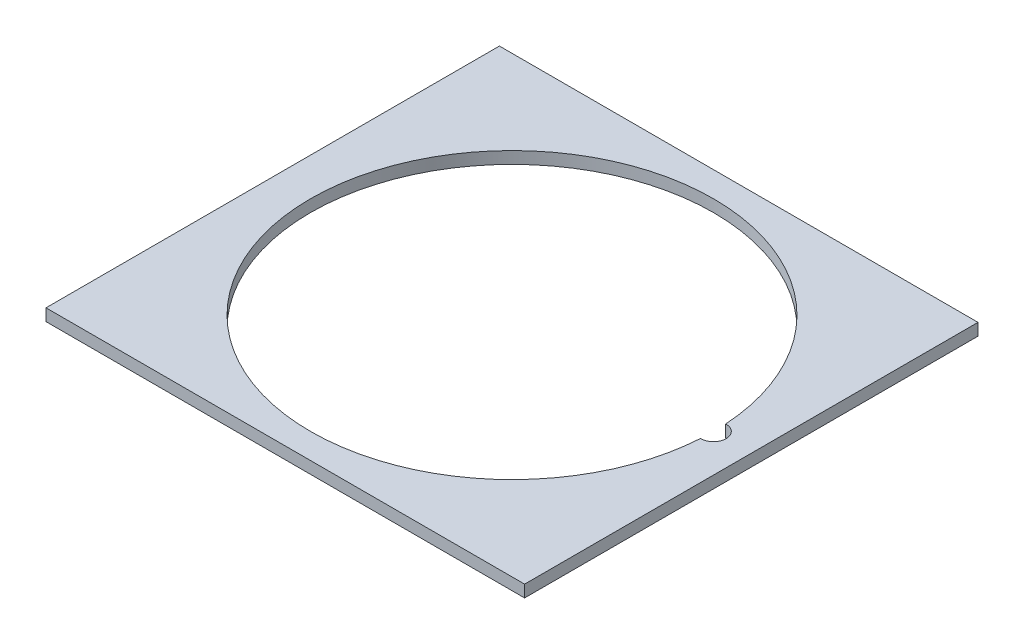
ISO-10303-21;
HEADER;
FILE_DESCRIPTION(('STEP AP214'),'2;1');
FILE_NAME('part.step','',(''),(''),'','','');
FILE_SCHEMA(('AUTOMOTIVE_DESIGN { 1 0 10303 214 1 1 1 1 }'));
ENDSEC;
DATA;
#1=APPLICATION_CONTEXT('core data for automotive mechanical design processes');
#2=APPLICATION_PROTOCOL_DEFINITION('international standard','automotive_design',2000,#1);
#3=PRODUCT_CONTEXT('',#1,'mechanical');
#4=PRODUCT('Part','Part','',(#3));
#5=PRODUCT_RELATED_PRODUCT_CATEGORY('part','',(#4));
#6=PRODUCT_DEFINITION_FORMATION('','',#4);
#7=PRODUCT_DEFINITION_CONTEXT('part definition',#1,'design');
#8=PRODUCT_DEFINITION('design','',#6,#7);
#9=PRODUCT_DEFINITION_SHAPE('','',#8);
#10=(LENGTH_UNIT() NAMED_UNIT(*) SI_UNIT(.MILLI.,.METRE.));
#11=(NAMED_UNIT(*) PLANE_ANGLE_UNIT() SI_UNIT($,.RADIAN.));
#12=(NAMED_UNIT(*) SI_UNIT($,.STERADIAN.) SOLID_ANGLE_UNIT());
#13=UNCERTAINTY_MEASURE_WITH_UNIT(LENGTH_MEASURE(1.E-05),#10,'distance_accuracy_value','');
#14=(GEOMETRIC_REPRESENTATION_CONTEXT(3) GLOBAL_UNCERTAINTY_ASSIGNED_CONTEXT((#13)) GLOBAL_UNIT_ASSIGNED_CONTEXT((#10,
#11,#12)) REPRESENTATION_CONTEXT('',''));
#15=CARTESIAN_POINT('',(0.,0.,0.));
#16=DIRECTION('',(0.,0.,1.));
#17=DIRECTION('',(1.,0.,0.));
#18=AXIS2_PLACEMENT_3D('',#15,#16,#17);
#19=CARTESIAN_POINT('',(-95.,4.7625,90.));
#20=DIRECTION('',(0.,1.,0.));
#21=DIRECTION('',(0.,0.,1.));
#22=AXIS2_PLACEMENT_3D('',#19,#20,#21);
#23=PLANE('',#22);
#24=DIRECTION('',(0.,0.,1.));
#25=VECTOR('',#24,1.);
#26=CARTESIAN_POINT('',(-95.,4.7625,-90.));
#27=LINE('',#26,#25);
#28=CARTESIAN_POINT('',(-95.,4.7625,-90.));
#29=VERTEX_POINT('',#28);
#30=CARTESIAN_POINT('',(-95.,4.7625,90.));
#31=VERTEX_POINT('',#30);
#32=EDGE_CURVE('E100',#29,#31,#27,.T.);
#33=ORIENTED_EDGE('',*,*,#32,.T.);
#34=DIRECTION('',(1.,0.,0.));
#35=VECTOR('',#34,1.);
#36=CARTESIAN_POINT('',(-95.,4.7625,90.));
#37=LINE('',#36,#35);
#38=CARTESIAN_POINT('',(95.,4.7625,90.));
#39=VERTEX_POINT('',#38);
#40=EDGE_CURVE('E103',#31,#39,#37,.T.);
#41=ORIENTED_EDGE('',*,*,#40,.T.);
#42=DIRECTION('',(0.,0.,-1.));
#43=VECTOR('',#42,1.);
#44=CARTESIAN_POINT('',(95.,4.7625,-90.));
#45=LINE('',#44,#43);
#46=CARTESIAN_POINT('',(95.,4.7625,-90.));
#47=VERTEX_POINT('',#46);
#48=EDGE_CURVE('E106',#39,#47,#45,.T.);
#49=ORIENTED_EDGE('',*,*,#48,.T.);
#50=DIRECTION('',(-1.,0.,0.));
#51=VECTOR('',#50,1.);
#52=CARTESIAN_POINT('',(-95.,4.7625,-90.));
#53=LINE('',#52,#51);
#54=EDGE_CURVE('E108',#47,#29,#53,.T.);
#55=ORIENTED_EDGE('',*,*,#54,.T.);
#56=EDGE_LOOP('',(#33,#41,#49,#55));
#57=FACE_BOUND('',#56,.T.);
#58=CARTESIAN_POINT('',(0.,4.7625,0.));
#59=DIRECTION('',(0.,1.,0.));
#60=DIRECTION('',(0.,0.,1.));
#61=AXIS2_PLACEMENT_3D('',#58,#59,#60);
#62=CIRCLE('',#61,80.);
#63=CARTESIAN_POINT('',(79.84375,4.7625,-4.99755799741234));
#64=VERTEX_POINT('',#63);
#65=CARTESIAN_POINT('',(79.84375,4.7625,4.99755799741233));
#66=VERTEX_POINT('',#65);
#67=EDGE_CURVE('E83',#64,#66,#62,.T.);
#68=ORIENTED_EDGE('',*,*,#67,.F.);
#69=CARTESIAN_POINT('',(80.,4.7625,0.));
#70=DIRECTION('',(0.,1.,0.));
#71=DIRECTION('',(0.,0.,1.));
#72=AXIS2_PLACEMENT_3D('',#69,#70,#71);
#73=CIRCLE('',#72,5.);
#74=EDGE_CURVE('E89',#66,#64,#73,.T.);
#75=ORIENTED_EDGE('',*,*,#74,.F.);
#76=EDGE_LOOP('',(#68,#75));
#77=FACE_BOUND('',#76,.T.);
#78=ADVANCED_FACE('F31',(#57,#77),#23,.T.);
#79=CARTESIAN_POINT('',(-95.,0.,90.));
#80=DIRECTION('',(0.,1.,0.));
#81=DIRECTION('',(0.,0.,1.));
#82=AXIS2_PLACEMENT_3D('',#79,#80,#81);
#83=PLANE('',#82);
#84=DIRECTION('',(0.,0.,1.));
#85=VECTOR('',#84,1.);
#86=CARTESIAN_POINT('',(-95.,0.,-90.));
#87=LINE('',#86,#85);
#88=CARTESIAN_POINT('',(-95.,0.,-90.));
#89=VERTEX_POINT('',#88);
#90=CARTESIAN_POINT('',(-95.,0.,90.));
#91=VERTEX_POINT('',#90);
#92=EDGE_CURVE('E99',#89,#91,#87,.T.);
#93=ORIENTED_EDGE('',*,*,#92,.F.);
#94=DIRECTION('',(-1.,0.,0.));
#95=VECTOR('',#94,1.);
#96=CARTESIAN_POINT('',(-95.,0.,-90.));
#97=LINE('',#96,#95);
#98=CARTESIAN_POINT('',(95.,0.,-90.));
#99=VERTEX_POINT('',#98);
#100=EDGE_CURVE('E104',#99,#89,#97,.T.);
#101=ORIENTED_EDGE('',*,*,#100,.F.);
#102=DIRECTION('',(0.,0.,-1.));
#103=VECTOR('',#102,1.);
#104=CARTESIAN_POINT('',(95.,0.,-90.));
#105=LINE('',#104,#103);
#106=CARTESIAN_POINT('',(95.,0.,90.));
#107=VERTEX_POINT('',#106);
#108=EDGE_CURVE('E115',#107,#99,#105,.T.);
#109=ORIENTED_EDGE('',*,*,#108,.F.);
#110=DIRECTION('',(1.,0.,0.));
#111=VECTOR('',#110,1.);
#112=CARTESIAN_POINT('',(-95.,0.,90.));
#113=LINE('',#112,#111);
#114=EDGE_CURVE('E113',#91,#107,#113,.T.);
#115=ORIENTED_EDGE('',*,*,#114,.F.);
#116=EDGE_LOOP('',(#93,#101,#109,#115));
#117=FACE_BOUND('',#116,.T.);
#118=CARTESIAN_POINT('',(80.,0.,0.));
#119=DIRECTION('',(0.,1.,0.));
#120=DIRECTION('',(0.,0.,1.));
#121=AXIS2_PLACEMENT_3D('',#118,#119,#120);
#122=CIRCLE('',#121,5.);
#123=CARTESIAN_POINT('',(79.84375,0.,4.99755799741233));
#124=VERTEX_POINT('',#123);
#125=CARTESIAN_POINT('',(79.84375,0.,-4.99755799741234));
#126=VERTEX_POINT('',#125);
#127=EDGE_CURVE('E53',#124,#126,#122,.T.);
#128=ORIENTED_EDGE('',*,*,#127,.T.);
#129=CARTESIAN_POINT('',(0.,0.,0.));
#130=DIRECTION('',(0.,1.,0.));
#131=DIRECTION('',(0.,0.,1.));
#132=AXIS2_PLACEMENT_3D('',#129,#130,#131);
#133=CIRCLE('',#132,80.);
#134=EDGE_CURVE('E93',#126,#124,#133,.T.);
#135=ORIENTED_EDGE('',*,*,#134,.T.);
#136=EDGE_LOOP('',(#128,#135));
#137=FACE_BOUND('',#136,.T.);
#138=ADVANCED_FACE('F133',(#117,#137),#83,.F.);
#139=CARTESIAN_POINT('',(-95.,4.7625,-90.));
#140=DIRECTION('',(1.,0.,0.));
#141=DIRECTION('',(0.,0.,-1.));
#142=AXIS2_PLACEMENT_3D('',#139,#140,#141);
#143=PLANE('',#142);
#144=ORIENTED_EDGE('',*,*,#92,.T.);
#145=DIRECTION('',(0.,-1.,0.));
#146=VECTOR('',#145,1.);
#147=CARTESIAN_POINT('',(-95.,4.7625,90.));
#148=LINE('',#147,#146);
#149=EDGE_CURVE('E11',#31,#91,#148,.T.);
#150=ORIENTED_EDGE('',*,*,#149,.F.);
#151=ORIENTED_EDGE('',*,*,#32,.F.);
#152=DIRECTION('',(0.,-1.,0.));
#153=VECTOR('',#152,1.);
#154=CARTESIAN_POINT('',(-95.,4.7625,-90.));
#155=LINE('',#154,#153);
#156=EDGE_CURVE('E110',#29,#89,#155,.T.);
#157=ORIENTED_EDGE('',*,*,#156,.T.);
#158=EDGE_LOOP('',(#144,#150,#151,#157));
#159=FACE_BOUND('',#158,.T.);
#160=ADVANCED_FACE('F33',(#159),#143,.F.);
#161=CARTESIAN_POINT('',(-95.,4.7625,90.));
#162=DIRECTION('',(0.,0.,-1.));
#163=DIRECTION('',(-1.,0.,0.));
#164=AXIS2_PLACEMENT_3D('',#161,#162,#163);
#165=PLANE('',#164);
#166=ORIENTED_EDGE('',*,*,#114,.T.);
#167=DIRECTION('',(0.,-1.,0.));
#168=VECTOR('',#167,1.);
#169=CARTESIAN_POINT('',(95.,4.7625,90.));
#170=LINE('',#169,#168);
#171=EDGE_CURVE('E39',#39,#107,#170,.T.);
#172=ORIENTED_EDGE('',*,*,#171,.F.);
#173=ORIENTED_EDGE('',*,*,#40,.F.);
#174=ORIENTED_EDGE('',*,*,#149,.T.);
#175=EDGE_LOOP('',(#166,#172,#173,#174));
#176=FACE_BOUND('',#175,.T.);
#177=ADVANCED_FACE('F143',(#176),#165,.F.);
#178=CARTESIAN_POINT('',(95.,4.7625,-90.));
#179=DIRECTION('',(-1.,0.,0.));
#180=DIRECTION('',(0.,0.,1.));
#181=AXIS2_PLACEMENT_3D('',#178,#179,#180);
#182=PLANE('',#181);
#183=ORIENTED_EDGE('',*,*,#108,.T.);
#184=DIRECTION('',(0.,-1.,0.));
#185=VECTOR('',#184,1.);
#186=CARTESIAN_POINT('',(95.,4.7625,-90.));
#187=LINE('',#186,#185);
#188=EDGE_CURVE('E120',#47,#99,#187,.T.);
#189=ORIENTED_EDGE('',*,*,#188,.F.);
#190=ORIENTED_EDGE('',*,*,#48,.F.);
#191=ORIENTED_EDGE('',*,*,#171,.T.);
#192=EDGE_LOOP('',(#183,#189,#190,#191));
#193=FACE_BOUND('',#192,.T.);
#194=ADVANCED_FACE('F127',(#193),#182,.F.);
#195=CARTESIAN_POINT('',(-95.,4.7625,-90.));
#196=DIRECTION('',(0.,0.,1.));
#197=DIRECTION('',(1.,0.,0.));
#198=AXIS2_PLACEMENT_3D('',#195,#196,#197);
#199=PLANE('',#198);
#200=ORIENTED_EDGE('',*,*,#100,.T.);
#201=ORIENTED_EDGE('',*,*,#156,.F.);
#202=ORIENTED_EDGE('',*,*,#54,.F.);
#203=ORIENTED_EDGE('',*,*,#188,.T.);
#204=EDGE_LOOP('',(#200,#201,#202,#203));
#205=FACE_BOUND('',#204,.T.);
#206=ADVANCED_FACE('F137',(#205),#199,.F.);
#207=CARTESIAN_POINT('',(80.,4.7625,0.));
#208=DIRECTION('',(0.,-1.,0.));
#209=DIRECTION('',(0.,0.,-1.));
#210=AXIS2_PLACEMENT_3D('',#207,#208,#209);
#211=CYLINDRICAL_SURFACE('',#210,5.);
#212=ORIENTED_EDGE('',*,*,#127,.F.);
#213=DIRECTION('',(0.,-1.,0.));
#214=VECTOR('',#213,1.);
#215=CARTESIAN_POINT('',(79.84375,4.7625,4.99755799741233));
#216=LINE('',#215,#214);
#217=EDGE_CURVE('E85',#66,#124,#216,.T.);
#218=ORIENTED_EDGE('',*,*,#217,.F.);
#219=ORIENTED_EDGE('',*,*,#74,.T.);
#220=DIRECTION('',(0.,-1.,0.));
#221=VECTOR('',#220,1.);
#222=CARTESIAN_POINT('',(79.84375,4.7625,-4.99755799741234));
#223=LINE('',#222,#221);
#224=EDGE_CURVE('E46',#64,#126,#223,.T.);
#225=ORIENTED_EDGE('',*,*,#224,.T.);
#226=EDGE_LOOP('',(#212,#218,#219,#225));
#227=FACE_BOUND('',#226,.T.);
#228=ADVANCED_FACE('F91',(#227),#211,.F.);
#229=CARTESIAN_POINT('',(0.,4.7625,0.));
#230=DIRECTION('',(0.,-1.,0.));
#231=DIRECTION('',(0.,0.,-1.));
#232=AXIS2_PLACEMENT_3D('',#229,#230,#231);
#233=CYLINDRICAL_SURFACE('',#232,80.);
#234=ORIENTED_EDGE('',*,*,#134,.F.);
#235=ORIENTED_EDGE('',*,*,#224,.F.);
#236=ORIENTED_EDGE('',*,*,#67,.T.);
#237=ORIENTED_EDGE('',*,*,#217,.T.);
#238=EDGE_LOOP('',(#234,#235,#236,#237));
#239=FACE_BOUND('',#238,.T.);
#240=ADVANCED_FACE('F84',(#239),#233,.F.);
#241=CLOSED_SHELL('',(#78,#138,#160,#177,#194,#206,#228,#240));
#242=MANIFOLD_SOLID_BREP('B2',#241);
#243=ADVANCED_BREP_SHAPE_REPRESENTATION('',(#18,#242),#14);
#244=SHAPE_DEFINITION_REPRESENTATION(#9,#243);
ENDSEC;
END-ISO-10303-21;
